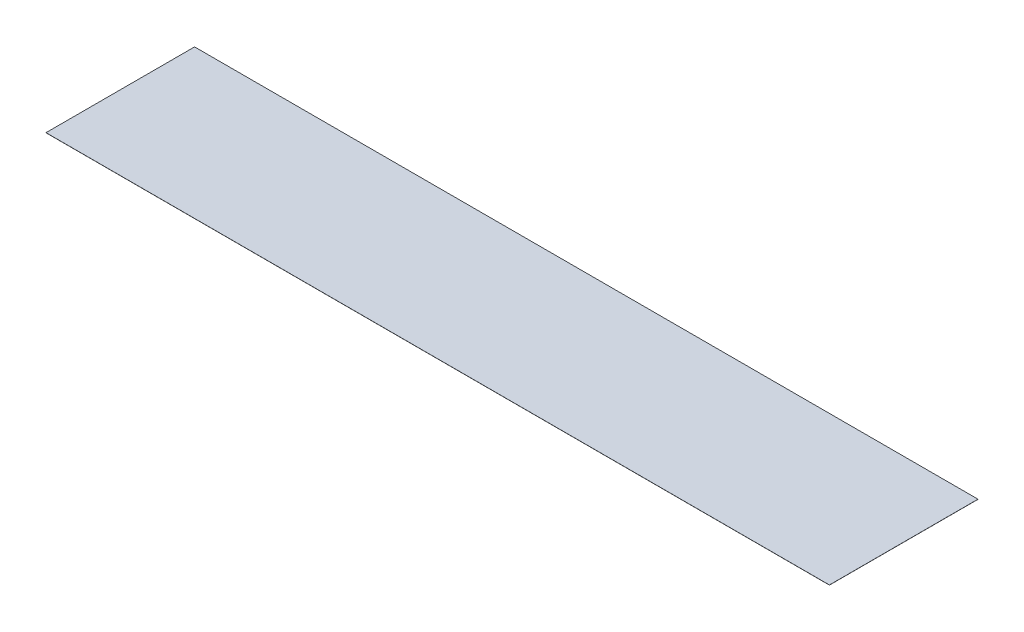
ISO-10303-21;
HEADER;
FILE_DESCRIPTION(('STEP AP214'),'2;1');
FILE_NAME('part.step','',(''),(''),'','','');
FILE_SCHEMA(('AUTOMOTIVE_DESIGN { 1 0 10303 214 1 1 1 1 }'));
ENDSEC;
DATA;
#1=APPLICATION_CONTEXT('core data for automotive mechanical design processes');
#2=APPLICATION_PROTOCOL_DEFINITION('international standard','automotive_design',2000,#1);
#3=PRODUCT_CONTEXT('',#1,'mechanical');
#4=PRODUCT('Part','Part','',(#3));
#5=PRODUCT_RELATED_PRODUCT_CATEGORY('part','',(#4));
#6=PRODUCT_DEFINITION_FORMATION('','',#4);
#7=PRODUCT_DEFINITION_CONTEXT('part definition',#1,'design');
#8=PRODUCT_DEFINITION('design','',#6,#7);
#9=PRODUCT_DEFINITION_SHAPE('','',#8);
#10=(LENGTH_UNIT() NAMED_UNIT(*) SI_UNIT(.MILLI.,.METRE.));
#11=(NAMED_UNIT(*) PLANE_ANGLE_UNIT() SI_UNIT($,.RADIAN.));
#12=(NAMED_UNIT(*) SI_UNIT($,.STERADIAN.) SOLID_ANGLE_UNIT());
#13=UNCERTAINTY_MEASURE_WITH_UNIT(LENGTH_MEASURE(1.E-05),#10,'distance_accuracy_value','');
#14=(GEOMETRIC_REPRESENTATION_CONTEXT(3) GLOBAL_UNCERTAINTY_ASSIGNED_CONTEXT((#13)) GLOBAL_UNIT_ASSIGNED_CONTEXT((#10,
#11,#12)) REPRESENTATION_CONTEXT('',''));
#15=CARTESIAN_POINT('',(0.,0.,0.));
#16=DIRECTION('',(0.,0.,1.));
#17=DIRECTION('',(1.,0.,0.));
#18=AXIS2_PLACEMENT_3D('',#15,#16,#17);
#19=CARTESIAN_POINT('',(0.,0.1,0.));
#20=DIRECTION('',(1.,0.,0.));
#21=DIRECTION('',(0.,0.,-1.));
#22=AXIS2_PLACEMENT_3D('',#19,#20,#21);
#23=PLANE('',#22);
#24=DIRECTION('',(0.,0.,1.));
#25=VECTOR('',#24,1.);
#26=CARTESIAN_POINT('',(0.,0.,0.));
#27=LINE('',#26,#25);
#28=CARTESIAN_POINT('',(0.,0.,-110.));
#29=VERTEX_POINT('',#28);
#30=CARTESIAN_POINT('',(0.,0.,0.));
#31=VERTEX_POINT('',#30);
#32=EDGE_CURVE('E107',#29,#31,#27,.T.);
#33=ORIENTED_EDGE('',*,*,#32,.T.);
#34=DIRECTION('',(0.,-1.,0.));
#35=VECTOR('',#34,1.);
#36=CARTESIAN_POINT('',(0.,0.1,0.));
#37=LINE('',#36,#35);
#38=CARTESIAN_POINT('',(0.,0.1,0.));
#39=VERTEX_POINT('',#38);
#40=EDGE_CURVE('E11',#39,#31,#37,.T.);
#41=ORIENTED_EDGE('',*,*,#40,.F.);
#42=DIRECTION('',(0.,0.,1.));
#43=VECTOR('',#42,1.);
#44=CARTESIAN_POINT('',(0.,0.1,0.));
#45=LINE('',#44,#43);
#46=CARTESIAN_POINT('',(0.,0.1,-110.));
#47=VERTEX_POINT('',#46);
#48=EDGE_CURVE('E91',#47,#39,#45,.T.);
#49=ORIENTED_EDGE('',*,*,#48,.F.);
#50=DIRECTION('',(0.,-1.,0.));
#51=VECTOR('',#50,1.);
#52=CARTESIAN_POINT('',(0.,0.1,-110.));
#53=LINE('',#52,#51);
#54=EDGE_CURVE('E103',#47,#29,#53,.T.);
#55=ORIENTED_EDGE('',*,*,#54,.T.);
#56=EDGE_LOOP('',(#33,#41,#49,#55));
#57=FACE_BOUND('',#56,.T.);
#58=ADVANCED_FACE('F39',(#57),#23,.F.);
#59=CARTESIAN_POINT('',(0.,0.1,0.));
#60=DIRECTION('',(0.,0.,-1.));
#61=DIRECTION('',(-1.,0.,0.));
#62=AXIS2_PLACEMENT_3D('',#59,#60,#61);
#63=PLANE('',#62);
#64=DIRECTION('',(1.,0.,0.));
#65=VECTOR('',#64,1.);
#66=CARTESIAN_POINT('',(0.,0.,0.));
#67=LINE('',#66,#65);
#68=CARTESIAN_POINT('',(580.,0.,0.));
#69=VERTEX_POINT('',#68);
#70=EDGE_CURVE('E96',#31,#69,#67,.T.);
#71=ORIENTED_EDGE('',*,*,#70,.T.);
#72=DIRECTION('',(0.,-1.,0.));
#73=VECTOR('',#72,1.);
#74=CARTESIAN_POINT('',(580.,0.1,0.));
#75=LINE('',#74,#73);
#76=CARTESIAN_POINT('',(580.,0.1,0.));
#77=VERTEX_POINT('',#76);
#78=EDGE_CURVE('E48',#77,#69,#75,.T.);
#79=ORIENTED_EDGE('',*,*,#78,.F.);
#80=DIRECTION('',(1.,0.,0.));
#81=VECTOR('',#80,1.);
#82=CARTESIAN_POINT('',(0.,0.1,0.));
#83=LINE('',#82,#81);
#84=EDGE_CURVE('E86',#39,#77,#83,.T.);
#85=ORIENTED_EDGE('',*,*,#84,.F.);
#86=ORIENTED_EDGE('',*,*,#40,.T.);
#87=EDGE_LOOP('',(#71,#79,#85,#86));
#88=FACE_BOUND('',#87,.T.);
#89=ADVANCED_FACE('F95',(#88),#63,.F.);
#90=CARTESIAN_POINT('',(580.,0.1,0.));
#91=DIRECTION('',(-1.,0.,0.));
#92=DIRECTION('',(0.,0.,1.));
#93=AXIS2_PLACEMENT_3D('',#90,#91,#92);
#94=PLANE('',#93);
#95=DIRECTION('',(0.,0.,-1.));
#96=VECTOR('',#95,1.);
#97=CARTESIAN_POINT('',(580.,0.,0.));
#98=LINE('',#97,#96);
#99=CARTESIAN_POINT('',(580.,0.,-110.));
#100=VERTEX_POINT('',#99);
#101=EDGE_CURVE('E73',#69,#100,#98,.T.);
#102=ORIENTED_EDGE('',*,*,#101,.T.);
#103=DIRECTION('',(0.,-1.,0.));
#104=VECTOR('',#103,1.);
#105=CARTESIAN_POINT('',(580.,0.1,-110.));
#106=LINE('',#105,#104);
#107=CARTESIAN_POINT('',(580.,0.1,-110.));
#108=VERTEX_POINT('',#107);
#109=EDGE_CURVE('E98',#108,#100,#106,.T.);
#110=ORIENTED_EDGE('',*,*,#109,.F.);
#111=DIRECTION('',(0.,0.,-1.));
#112=VECTOR('',#111,1.);
#113=CARTESIAN_POINT('',(580.,0.1,0.));
#114=LINE('',#113,#112);
#115=EDGE_CURVE('E89',#77,#108,#114,.T.);
#116=ORIENTED_EDGE('',*,*,#115,.F.);
#117=ORIENTED_EDGE('',*,*,#78,.T.);
#118=EDGE_LOOP('',(#102,#110,#116,#117));
#119=FACE_BOUND('',#118,.T.);
#120=ADVANCED_FACE('F99',(#119),#94,.F.);
#121=CARTESIAN_POINT('',(0.,0.1,-110.));
#122=DIRECTION('',(0.,0.,1.));
#123=DIRECTION('',(1.,0.,0.));
#124=AXIS2_PLACEMENT_3D('',#121,#122,#123);
#125=PLANE('',#124);
#126=DIRECTION('',(-1.,0.,0.));
#127=VECTOR('',#126,1.);
#128=CARTESIAN_POINT('',(0.,0.,-110.));
#129=LINE('',#128,#127);
#130=EDGE_CURVE('E79',#100,#29,#129,.T.);
#131=ORIENTED_EDGE('',*,*,#130,.T.);
#132=ORIENTED_EDGE('',*,*,#54,.F.);
#133=DIRECTION('',(-1.,0.,0.));
#134=VECTOR('',#133,1.);
#135=CARTESIAN_POINT('',(0.,0.1,-110.));
#136=LINE('',#135,#134);
#137=EDGE_CURVE('E56',#108,#47,#136,.T.);
#138=ORIENTED_EDGE('',*,*,#137,.F.);
#139=ORIENTED_EDGE('',*,*,#109,.T.);
#140=EDGE_LOOP('',(#131,#132,#138,#139));
#141=FACE_BOUND('',#140,.T.);
#142=ADVANCED_FACE('F120',(#141),#125,.F.);
#143=CARTESIAN_POINT('',(0.,0.1,0.));
#144=DIRECTION('',(0.,-1.,0.));
#145=DIRECTION('',(0.,0.,-1.));
#146=AXIS2_PLACEMENT_3D('',#143,#144,#145);
#147=PLANE('',#146);
#148=ORIENTED_EDGE('',*,*,#48,.T.);
#149=ORIENTED_EDGE('',*,*,#84,.T.);
#150=ORIENTED_EDGE('',*,*,#115,.T.);
#151=ORIENTED_EDGE('',*,*,#137,.T.);
#152=EDGE_LOOP('',(#148,#149,#150,#151));
#153=FACE_BOUND('',#152,.T.);
#154=ADVANCED_FACE('F87',(#153),#147,.F.);
#155=CARTESIAN_POINT('',(0.,0.,0.));
#156=DIRECTION('',(0.,-1.,0.));
#157=DIRECTION('',(0.,0.,-1.));
#158=AXIS2_PLACEMENT_3D('',#155,#156,#157);
#159=PLANE('',#158);
#160=ORIENTED_EDGE('',*,*,#32,.F.);
#161=ORIENTED_EDGE('',*,*,#130,.F.);
#162=ORIENTED_EDGE('',*,*,#101,.F.);
#163=ORIENTED_EDGE('',*,*,#70,.F.);
#164=EDGE_LOOP('',(#160,#161,#162,#163));
#165=FACE_BOUND('',#164,.T.);
#166=ADVANCED_FACE('F123',(#165),#159,.T.);
#167=CLOSED_SHELL('',(#58,#89,#120,#142,#154,#166));
#168=MANIFOLD_SOLID_BREP('B2',#167);
#169=ADVANCED_BREP_SHAPE_REPRESENTATION('',(#18,#168),#14);
#170=SHAPE_DEFINITION_REPRESENTATION(#9,#169);
ENDSEC;
END-ISO-10303-21;
